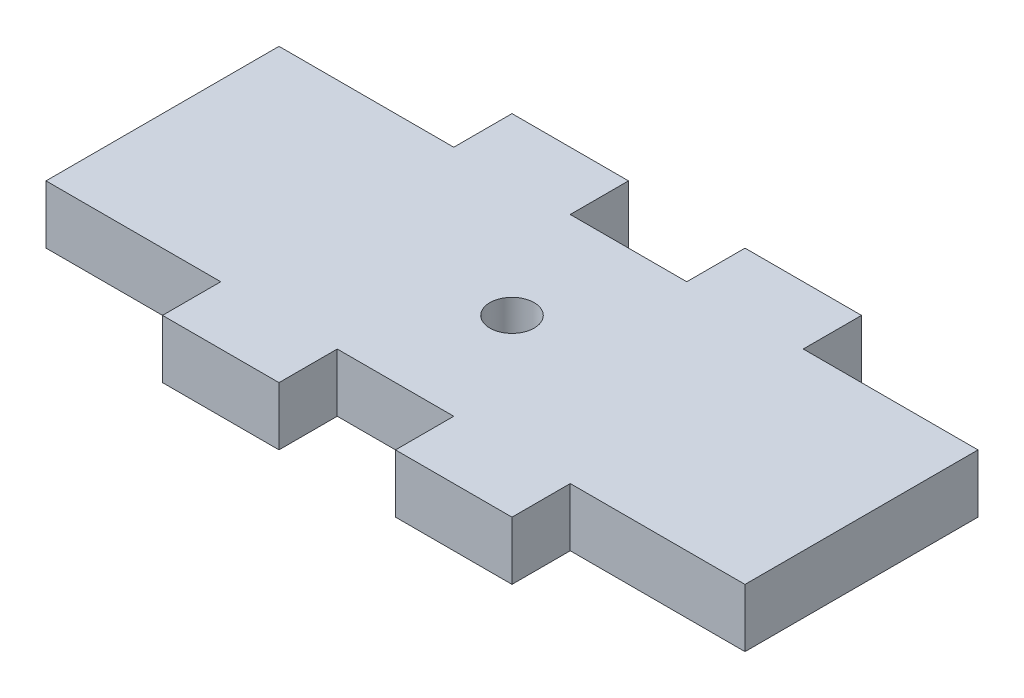
ISO-10303-21;
HEADER;
FILE_DESCRIPTION(('STEP AP214'),'2;1');
FILE_NAME('part.step','',(''),(''),'','','');
FILE_SCHEMA(('AUTOMOTIVE_DESIGN { 1 0 10303 214 1 1 1 1 }'));
ENDSEC;
DATA;
#1=APPLICATION_CONTEXT('core data for automotive mechanical design processes');
#2=APPLICATION_PROTOCOL_DEFINITION('international standard','automotive_design',2000,#1);
#3=PRODUCT_CONTEXT('',#1,'mechanical');
#4=PRODUCT('Part','Part','',(#3));
#5=PRODUCT_RELATED_PRODUCT_CATEGORY('part','',(#4));
#6=PRODUCT_DEFINITION_FORMATION('','',#4);
#7=PRODUCT_DEFINITION_CONTEXT('part definition',#1,'design');
#8=PRODUCT_DEFINITION('design','',#6,#7);
#9=PRODUCT_DEFINITION_SHAPE('','',#8);
#10=(LENGTH_UNIT() NAMED_UNIT(*) SI_UNIT(.MILLI.,.METRE.));
#11=(NAMED_UNIT(*) PLANE_ANGLE_UNIT() SI_UNIT($,.RADIAN.));
#12=(NAMED_UNIT(*) SI_UNIT($,.STERADIAN.) SOLID_ANGLE_UNIT());
#13=UNCERTAINTY_MEASURE_WITH_UNIT(LENGTH_MEASURE(1.E-05),#10,'distance_accuracy_value','');
#14=(GEOMETRIC_REPRESENTATION_CONTEXT(3) GLOBAL_UNCERTAINTY_ASSIGNED_CONTEXT((#13)) GLOBAL_UNIT_ASSIGNED_CONTEXT((#10,
#11,#12)) REPRESENTATION_CONTEXT('',''));
#15=CARTESIAN_POINT('',(0.,0.,0.));
#16=DIRECTION('',(0.,0.,1.));
#17=DIRECTION('',(1.,0.,0.));
#18=AXIS2_PLACEMENT_3D('',#15,#16,#17);
#19=CARTESIAN_POINT('',(12.7,6.35,0.));
#20=DIRECTION('',(1.,0.,0.));
#21=DIRECTION('',(0.,0.,-1.));
#22=AXIS2_PLACEMENT_3D('',#19,#20,#21);
#23=PLANE('',#22);
#24=DIRECTION('',(0.,0.,1.));
#25=VECTOR('',#24,1.);
#26=CARTESIAN_POINT('',(12.7,0.,0.));
#27=LINE('',#26,#25);
#28=CARTESIAN_POINT('',(12.7,0.,12.7));
#29=VERTEX_POINT('',#28);
#30=CARTESIAN_POINT('',(12.7,0.,19.05));
#31=VERTEX_POINT('',#30);
#32=EDGE_CURVE('E248',#29,#31,#27,.T.);
#33=ORIENTED_EDGE('',*,*,#32,.F.);
#34=DIRECTION('',(0.,-1.,0.));
#35=VECTOR('',#34,1.);
#36=CARTESIAN_POINT('',(12.7,6.35,12.7));
#37=LINE('',#36,#35);
#38=CARTESIAN_POINT('',(12.7,6.35,12.7));
#39=VERTEX_POINT('',#38);
#40=EDGE_CURVE('E11',#39,#29,#37,.T.);
#41=ORIENTED_EDGE('',*,*,#40,.F.);
#42=DIRECTION('',(0.,0.,1.));
#43=VECTOR('',#42,1.);
#44=CARTESIAN_POINT('',(12.7,6.35,0.));
#45=LINE('',#44,#43);
#46=CARTESIAN_POINT('',(12.7,6.35,19.05));
#47=VERTEX_POINT('',#46);
#48=EDGE_CURVE('E390',#39,#47,#45,.T.);
#49=ORIENTED_EDGE('',*,*,#48,.T.);
#50=DIRECTION('',(0.,-1.,0.));
#51=VECTOR('',#50,1.);
#52=CARTESIAN_POINT('',(12.7,6.35,19.05));
#53=LINE('',#52,#51);
#54=EDGE_CURVE('E122',#47,#31,#53,.T.);
#55=ORIENTED_EDGE('',*,*,#54,.T.);
#56=EDGE_LOOP('',(#33,#41,#49,#55));
#57=FACE_BOUND('',#56,.T.);
#58=ADVANCED_FACE('F35',(#57),#23,.T.);
#59=CARTESIAN_POINT('',(0.,6.35,12.7));
#60=DIRECTION('',(0.,0.,-1.));
#61=DIRECTION('',(-1.,0.,0.));
#62=AXIS2_PLACEMENT_3D('',#59,#60,#61);
#63=PLANE('',#62);
#64=DIRECTION('',(1.,0.,0.));
#65=VECTOR('',#64,1.);
#66=CARTESIAN_POINT('',(0.,0.,12.7));
#67=LINE('',#66,#65);
#68=CARTESIAN_POINT('',(31.75,0.,12.7));
#69=VERTEX_POINT('',#68);
#70=EDGE_CURVE('E246',#29,#69,#67,.T.);
#71=ORIENTED_EDGE('',*,*,#70,.T.);
#72=DIRECTION('',(0.,-1.,0.));
#73=VECTOR('',#72,1.);
#74=CARTESIAN_POINT('',(31.75,6.35,12.7));
#75=LINE('',#74,#73);
#76=CARTESIAN_POINT('',(31.75,6.35,12.7));
#77=VERTEX_POINT('',#76);
#78=EDGE_CURVE('E44',#77,#69,#75,.T.);
#79=ORIENTED_EDGE('',*,*,#78,.F.);
#80=DIRECTION('',(1.,0.,0.));
#81=VECTOR('',#80,1.);
#82=CARTESIAN_POINT('',(0.,6.35,12.7));
#83=LINE('',#82,#81);
#84=EDGE_CURVE('E392',#39,#77,#83,.T.);
#85=ORIENTED_EDGE('',*,*,#84,.F.);
#86=ORIENTED_EDGE('',*,*,#40,.T.);
#87=EDGE_LOOP('',(#71,#79,#85,#86));
#88=FACE_BOUND('',#87,.T.);
#89=ADVANCED_FACE('F247',(#88),#63,.F.);
#90=CARTESIAN_POINT('',(31.75,6.35,0.));
#91=DIRECTION('',(-1.,0.,0.));
#92=DIRECTION('',(0.,0.,1.));
#93=AXIS2_PLACEMENT_3D('',#90,#91,#92);
#94=PLANE('',#93);
#95=DIRECTION('',(0.,0.,-1.));
#96=VECTOR('',#95,1.);
#97=CARTESIAN_POINT('',(31.75,0.,0.));
#98=LINE('',#97,#96);
#99=CARTESIAN_POINT('',(31.75,0.,-12.7));
#100=VERTEX_POINT('',#99);
#101=EDGE_CURVE('E240',#69,#100,#98,.T.);
#102=ORIENTED_EDGE('',*,*,#101,.T.);
#103=DIRECTION('',(0.,-1.,0.));
#104=VECTOR('',#103,1.);
#105=CARTESIAN_POINT('',(31.75,6.35,-12.7));
#106=LINE('',#105,#104);
#107=CARTESIAN_POINT('',(31.75,6.35,-12.7));
#108=VERTEX_POINT('',#107);
#109=EDGE_CURVE('E232',#108,#100,#106,.T.);
#110=ORIENTED_EDGE('',*,*,#109,.F.);
#111=DIRECTION('',(0.,0.,-1.));
#112=VECTOR('',#111,1.);
#113=CARTESIAN_POINT('',(31.75,6.35,0.));
#114=LINE('',#113,#112);
#115=EDGE_CURVE('E242',#77,#108,#114,.T.);
#116=ORIENTED_EDGE('',*,*,#115,.F.);
#117=ORIENTED_EDGE('',*,*,#78,.T.);
#118=EDGE_LOOP('',(#102,#110,#116,#117));
#119=FACE_BOUND('',#118,.T.);
#120=ADVANCED_FACE('F238',(#119),#94,.F.);
#121=CARTESIAN_POINT('',(0.,6.35,-12.7));
#122=DIRECTION('',(0.,0.,-1.));
#123=DIRECTION('',(-1.,0.,0.));
#124=AXIS2_PLACEMENT_3D('',#121,#122,#123);
#125=PLANE('',#124);
#126=DIRECTION('',(1.,0.,0.));
#127=VECTOR('',#126,1.);
#128=CARTESIAN_POINT('',(0.,0.,-12.7));
#129=LINE('',#128,#127);
#130=CARTESIAN_POINT('',(12.7,0.,-12.7));
#131=VERTEX_POINT('',#130);
#132=EDGE_CURVE('E250',#131,#100,#129,.T.);
#133=ORIENTED_EDGE('',*,*,#132,.F.);
#134=DIRECTION('',(0.,-1.,0.));
#135=VECTOR('',#134,1.);
#136=CARTESIAN_POINT('',(12.7,6.35,-12.7));
#137=LINE('',#136,#135);
#138=CARTESIAN_POINT('',(12.7,6.35,-12.7));
#139=VERTEX_POINT('',#138);
#140=EDGE_CURVE('E230',#139,#131,#137,.T.);
#141=ORIENTED_EDGE('',*,*,#140,.F.);
#142=DIRECTION('',(1.,0.,0.));
#143=VECTOR('',#142,1.);
#144=CARTESIAN_POINT('',(0.,6.35,-12.7));
#145=LINE('',#144,#143);
#146=EDGE_CURVE('E397',#139,#108,#145,.T.);
#147=ORIENTED_EDGE('',*,*,#146,.T.);
#148=ORIENTED_EDGE('',*,*,#109,.T.);
#149=EDGE_LOOP('',(#133,#141,#147,#148));
#150=FACE_BOUND('',#149,.T.);
#151=ADVANCED_FACE('F325',(#150),#125,.T.);
#152=CARTESIAN_POINT('',(12.7,6.35,0.));
#153=DIRECTION('',(-1.,0.,0.));
#154=DIRECTION('',(0.,0.,1.));
#155=AXIS2_PLACEMENT_3D('',#152,#153,#154);
#156=PLANE('',#155);
#157=DIRECTION('',(0.,0.,-1.));
#158=VECTOR('',#157,1.);
#159=CARTESIAN_POINT('',(12.7,0.,0.));
#160=LINE('',#159,#158);
#161=CARTESIAN_POINT('',(12.7,0.,-19.05));
#162=VERTEX_POINT('',#161);
#163=EDGE_CURVE('E257',#131,#162,#160,.T.);
#164=ORIENTED_EDGE('',*,*,#163,.T.);
#165=DIRECTION('',(0.,-1.,0.));
#166=VECTOR('',#165,1.);
#167=CARTESIAN_POINT('',(12.7,6.35,-19.05));
#168=LINE('',#167,#166);
#169=CARTESIAN_POINT('',(12.7,6.35,-19.05));
#170=VERTEX_POINT('',#169);
#171=EDGE_CURVE('E228',#170,#162,#168,.T.);
#172=ORIENTED_EDGE('',*,*,#171,.F.);
#173=DIRECTION('',(0.,0.,-1.));
#174=VECTOR('',#173,1.);
#175=CARTESIAN_POINT('',(12.7,6.35,0.));
#176=LINE('',#175,#174);
#177=EDGE_CURVE('E400',#139,#170,#176,.T.);
#178=ORIENTED_EDGE('',*,*,#177,.F.);
#179=ORIENTED_EDGE('',*,*,#140,.T.);
#180=EDGE_LOOP('',(#164,#172,#178,#179));
#181=FACE_BOUND('',#180,.T.);
#182=ADVANCED_FACE('F328',(#181),#156,.F.);
#183=CARTESIAN_POINT('',(0.,6.35,-19.05));
#184=DIRECTION('',(0.,0.,-1.));
#185=DIRECTION('',(-1.,0.,0.));
#186=AXIS2_PLACEMENT_3D('',#183,#184,#185);
#187=PLANE('',#186);
#188=DIRECTION('',(1.,0.,0.));
#189=VECTOR('',#188,1.);
#190=CARTESIAN_POINT('',(0.,0.,-19.05));
#191=LINE('',#190,#189);
#192=CARTESIAN_POINT('',(0.,0.,-19.05));
#193=VERTEX_POINT('',#192);
#194=EDGE_CURVE('E260',#193,#162,#191,.T.);
#195=ORIENTED_EDGE('',*,*,#194,.F.);
#196=DIRECTION('',(0.,-1.,0.));
#197=VECTOR('',#196,1.);
#198=CARTESIAN_POINT('',(0.,6.35,-19.05));
#199=LINE('',#198,#197);
#200=CARTESIAN_POINT('',(0.,6.35,-19.05));
#201=VERTEX_POINT('',#200);
#202=EDGE_CURVE('E226',#201,#193,#199,.T.);
#203=ORIENTED_EDGE('',*,*,#202,.F.);
#204=DIRECTION('',(1.,0.,0.));
#205=VECTOR('',#204,1.);
#206=CARTESIAN_POINT('',(0.,6.35,-19.05));
#207=LINE('',#206,#205);
#208=EDGE_CURVE('E402',#201,#170,#207,.T.);
#209=ORIENTED_EDGE('',*,*,#208,.T.);
#210=ORIENTED_EDGE('',*,*,#171,.T.);
#211=EDGE_LOOP('',(#195,#203,#209,#210));
#212=FACE_BOUND('',#211,.T.);
#213=ADVANCED_FACE('F332',(#212),#187,.T.);
#214=CARTESIAN_POINT('',(0.,6.35,0.));
#215=DIRECTION('',(-1.,0.,0.));
#216=DIRECTION('',(0.,0.,1.));
#217=AXIS2_PLACEMENT_3D('',#214,#215,#216);
#218=PLANE('',#217);
#219=DIRECTION('',(0.,0.,-1.));
#220=VECTOR('',#219,1.);
#221=CARTESIAN_POINT('',(0.,0.,0.));
#222=LINE('',#221,#220);
#223=CARTESIAN_POINT('',(0.,0.,-12.7));
#224=VERTEX_POINT('',#223);
#225=EDGE_CURVE('E263',#224,#193,#222,.T.);
#226=ORIENTED_EDGE('',*,*,#225,.F.);
#227=DIRECTION('',(0.,-1.,0.));
#228=VECTOR('',#227,1.);
#229=CARTESIAN_POINT('',(0.,6.35,-12.7));
#230=LINE('',#229,#228);
#231=CARTESIAN_POINT('',(0.,6.35,-12.7));
#232=VERTEX_POINT('',#231);
#233=EDGE_CURVE('E224',#232,#224,#230,.T.);
#234=ORIENTED_EDGE('',*,*,#233,.F.);
#235=DIRECTION('',(0.,0.,-1.));
#236=VECTOR('',#235,1.);
#237=CARTESIAN_POINT('',(0.,6.35,0.));
#238=LINE('',#237,#236);
#239=EDGE_CURVE('E405',#232,#201,#238,.T.);
#240=ORIENTED_EDGE('',*,*,#239,.T.);
#241=ORIENTED_EDGE('',*,*,#202,.T.);
#242=EDGE_LOOP('',(#226,#234,#240,#241));
#243=FACE_BOUND('',#242,.T.);
#244=ADVANCED_FACE('F336',(#243),#218,.T.);
#245=CARTESIAN_POINT('',(0.,6.35,-12.7));
#246=DIRECTION('',(0.,0.,-1.));
#247=DIRECTION('',(-1.,0.,0.));
#248=AXIS2_PLACEMENT_3D('',#245,#246,#247);
#249=PLANE('',#248);
#250=DIRECTION('',(1.,0.,0.));
#251=VECTOR('',#250,1.);
#252=CARTESIAN_POINT('',(0.,0.,-12.7));
#253=LINE('',#252,#251);
#254=CARTESIAN_POINT('',(-12.7,0.,-12.7));
#255=VERTEX_POINT('',#254);
#256=EDGE_CURVE('E266',#255,#224,#253,.T.);
#257=ORIENTED_EDGE('',*,*,#256,.F.);
#258=DIRECTION('',(0.,-1.,0.));
#259=VECTOR('',#258,1.);
#260=CARTESIAN_POINT('',(-12.7,6.35,-12.7));
#261=LINE('',#260,#259);
#262=CARTESIAN_POINT('',(-12.7,6.35,-12.7));
#263=VERTEX_POINT('',#262);
#264=EDGE_CURVE('E222',#263,#255,#261,.T.);
#265=ORIENTED_EDGE('',*,*,#264,.F.);
#266=DIRECTION('',(1.,0.,0.));
#267=VECTOR('',#266,1.);
#268=CARTESIAN_POINT('',(0.,6.35,-12.7));
#269=LINE('',#268,#267);
#270=EDGE_CURVE('E408',#263,#232,#269,.T.);
#271=ORIENTED_EDGE('',*,*,#270,.T.);
#272=ORIENTED_EDGE('',*,*,#233,.T.);
#273=EDGE_LOOP('',(#257,#265,#271,#272));
#274=FACE_BOUND('',#273,.T.);
#275=ADVANCED_FACE('F340',(#274),#249,.T.);
#276=CARTESIAN_POINT('',(-12.7,6.35,0.));
#277=DIRECTION('',(-1.,0.,0.));
#278=DIRECTION('',(0.,0.,1.));
#279=AXIS2_PLACEMENT_3D('',#276,#277,#278);
#280=PLANE('',#279);
#281=DIRECTION('',(0.,0.,-1.));
#282=VECTOR('',#281,1.);
#283=CARTESIAN_POINT('',(-12.7,0.,0.));
#284=LINE('',#283,#282);
#285=CARTESIAN_POINT('',(-12.7,0.,-19.05));
#286=VERTEX_POINT('',#285);
#287=EDGE_CURVE('E269',#255,#286,#284,.T.);
#288=ORIENTED_EDGE('',*,*,#287,.T.);
#289=DIRECTION('',(0.,-1.,0.));
#290=VECTOR('',#289,1.);
#291=CARTESIAN_POINT('',(-12.7,6.35,-19.05));
#292=LINE('',#291,#290);
#293=CARTESIAN_POINT('',(-12.7,6.35,-19.05));
#294=VERTEX_POINT('',#293);
#295=EDGE_CURVE('E219',#294,#286,#292,.T.);
#296=ORIENTED_EDGE('',*,*,#295,.F.);
#297=DIRECTION('',(0.,0.,-1.));
#298=VECTOR('',#297,1.);
#299=CARTESIAN_POINT('',(-12.7,6.35,0.));
#300=LINE('',#299,#298);
#301=EDGE_CURVE('E411',#263,#294,#300,.T.);
#302=ORIENTED_EDGE('',*,*,#301,.F.);
#303=ORIENTED_EDGE('',*,*,#264,.T.);
#304=EDGE_LOOP('',(#288,#296,#302,#303));
#305=FACE_BOUND('',#304,.T.);
#306=ADVANCED_FACE('F344',(#305),#280,.F.);
#307=CARTESIAN_POINT('',(0.,6.35,-19.05));
#308=DIRECTION('',(0.,0.,1.));
#309=DIRECTION('',(1.,0.,0.));
#310=AXIS2_PLACEMENT_3D('',#307,#308,#309);
#311=PLANE('',#310);
#312=DIRECTION('',(-1.,0.,0.));
#313=VECTOR('',#312,1.);
#314=CARTESIAN_POINT('',(0.,0.,-19.05));
#315=LINE('',#314,#313);
#316=CARTESIAN_POINT('',(-25.4,0.,-19.05));
#317=VERTEX_POINT('',#316);
#318=EDGE_CURVE('E272',#286,#317,#315,.T.);
#319=ORIENTED_EDGE('',*,*,#318,.T.);
#320=DIRECTION('',(0.,-1.,0.));
#321=VECTOR('',#320,1.);
#322=CARTESIAN_POINT('',(-25.4,6.35,-19.05));
#323=LINE('',#322,#321);
#324=CARTESIAN_POINT('',(-25.4,6.35,-19.05));
#325=VERTEX_POINT('',#324);
#326=EDGE_CURVE('E217',#325,#317,#323,.T.);
#327=ORIENTED_EDGE('',*,*,#326,.F.);
#328=DIRECTION('',(-1.,0.,0.));
#329=VECTOR('',#328,1.);
#330=CARTESIAN_POINT('',(0.,6.35,-19.05));
#331=LINE('',#330,#329);
#332=EDGE_CURVE('E414',#294,#325,#331,.T.);
#333=ORIENTED_EDGE('',*,*,#332,.F.);
#334=ORIENTED_EDGE('',*,*,#295,.T.);
#335=EDGE_LOOP('',(#319,#327,#333,#334));
#336=FACE_BOUND('',#335,.T.);
#337=ADVANCED_FACE('F348',(#336),#311,.F.);
#338=CARTESIAN_POINT('',(-25.4,6.35,0.));
#339=DIRECTION('',(-1.,0.,0.));
#340=DIRECTION('',(0.,0.,1.));
#341=AXIS2_PLACEMENT_3D('',#338,#339,#340);
#342=PLANE('',#341);
#343=DIRECTION('',(0.,0.,-1.));
#344=VECTOR('',#343,1.);
#345=CARTESIAN_POINT('',(-25.4,0.,0.));
#346=LINE('',#345,#344);
#347=CARTESIAN_POINT('',(-25.4,0.,-12.7));
#348=VERTEX_POINT('',#347);
#349=EDGE_CURVE('E275',#348,#317,#346,.T.);
#350=ORIENTED_EDGE('',*,*,#349,.F.);
#351=DIRECTION('',(0.,-1.,0.));
#352=VECTOR('',#351,1.);
#353=CARTESIAN_POINT('',(-25.4,6.35,-12.7));
#354=LINE('',#353,#352);
#355=CARTESIAN_POINT('',(-25.4,6.35,-12.7));
#356=VERTEX_POINT('',#355);
#357=EDGE_CURVE('E215',#356,#348,#354,.T.);
#358=ORIENTED_EDGE('',*,*,#357,.F.);
#359=DIRECTION('',(0.,0.,-1.));
#360=VECTOR('',#359,1.);
#361=CARTESIAN_POINT('',(-25.4,6.35,0.));
#362=LINE('',#361,#360);
#363=EDGE_CURVE('E416',#356,#325,#362,.T.);
#364=ORIENTED_EDGE('',*,*,#363,.T.);
#365=ORIENTED_EDGE('',*,*,#326,.T.);
#366=EDGE_LOOP('',(#350,#358,#364,#365));
#367=FACE_BOUND('',#366,.T.);
#368=ADVANCED_FACE('F352',(#367),#342,.T.);
#369=CARTESIAN_POINT('',(0.,6.35,-12.6999999999999));
#370=DIRECTION('',(0.,0.,-1.));
#371=DIRECTION('',(-1.,0.,0.));
#372=AXIS2_PLACEMENT_3D('',#369,#370,#371);
#373=PLANE('',#372);
#374=DIRECTION('',(1.,0.,0.));
#375=VECTOR('',#374,1.);
#376=CARTESIAN_POINT('',(0.,0.,-12.6999999999999));
#377=LINE('',#376,#375);
#378=CARTESIAN_POINT('',(-44.45,0.,-12.7));
#379=VERTEX_POINT('',#378);
#380=EDGE_CURVE('E278',#379,#348,#377,.T.);
#381=ORIENTED_EDGE('',*,*,#380,.F.);
#382=DIRECTION('',(0.,-1.,0.));
#383=VECTOR('',#382,1.);
#384=CARTESIAN_POINT('',(-44.45,6.35,-12.7));
#385=LINE('',#384,#383);
#386=CARTESIAN_POINT('',(-44.45,6.35,-12.7));
#387=VERTEX_POINT('',#386);
#388=EDGE_CURVE('E213',#387,#379,#385,.T.);
#389=ORIENTED_EDGE('',*,*,#388,.F.);
#390=DIRECTION('',(1.,0.,0.));
#391=VECTOR('',#390,1.);
#392=CARTESIAN_POINT('',(0.,6.35,-12.6999999999999));
#393=LINE('',#392,#391);
#394=EDGE_CURVE('E419',#387,#356,#393,.T.);
#395=ORIENTED_EDGE('',*,*,#394,.T.);
#396=ORIENTED_EDGE('',*,*,#357,.T.);
#397=EDGE_LOOP('',(#381,#389,#395,#396));
#398=FACE_BOUND('',#397,.T.);
#399=ADVANCED_FACE('F356',(#398),#373,.T.);
#400=CARTESIAN_POINT('',(-44.45,6.35,0.));
#401=DIRECTION('',(1.,0.,0.));
#402=DIRECTION('',(0.,0.,-1.));
#403=AXIS2_PLACEMENT_3D('',#400,#401,#402);
#404=PLANE('',#403);
#405=DIRECTION('',(0.,0.,1.));
#406=VECTOR('',#405,1.);
#407=CARTESIAN_POINT('',(-44.45,0.,0.));
#408=LINE('',#407,#406);
#409=CARTESIAN_POINT('',(-44.45,0.,12.7));
#410=VERTEX_POINT('',#409);
#411=EDGE_CURVE('E281',#379,#410,#408,.T.);
#412=ORIENTED_EDGE('',*,*,#411,.T.);
#413=DIRECTION('',(0.,-1.,0.));
#414=VECTOR('',#413,1.);
#415=CARTESIAN_POINT('',(-44.45,6.35,12.7));
#416=LINE('',#415,#414);
#417=CARTESIAN_POINT('',(-44.45,6.35,12.7));
#418=VERTEX_POINT('',#417);
#419=EDGE_CURVE('E211',#418,#410,#416,.T.);
#420=ORIENTED_EDGE('',*,*,#419,.F.);
#421=DIRECTION('',(0.,0.,1.));
#422=VECTOR('',#421,1.);
#423=CARTESIAN_POINT('',(-44.45,6.35,0.));
#424=LINE('',#423,#422);
#425=EDGE_CURVE('E422',#387,#418,#424,.T.);
#426=ORIENTED_EDGE('',*,*,#425,.F.);
#427=ORIENTED_EDGE('',*,*,#388,.T.);
#428=EDGE_LOOP('',(#412,#420,#426,#427));
#429=FACE_BOUND('',#428,.T.);
#430=ADVANCED_FACE('F360',(#429),#404,.F.);
#431=CARTESIAN_POINT('',(0.,6.35,12.7));
#432=DIRECTION('',(0.,0.,1.));
#433=DIRECTION('',(1.,0.,0.));
#434=AXIS2_PLACEMENT_3D('',#431,#432,#433);
#435=PLANE('',#434);
#436=DIRECTION('',(-1.,0.,0.));
#437=VECTOR('',#436,1.);
#438=CARTESIAN_POINT('',(0.,0.,12.7));
#439=LINE('',#438,#437);
#440=CARTESIAN_POINT('',(-25.4,0.,12.7));
#441=VERTEX_POINT('',#440);
#442=EDGE_CURVE('E284',#441,#410,#439,.T.);
#443=ORIENTED_EDGE('',*,*,#442,.F.);
#444=DIRECTION('',(0.,-1.,0.));
#445=VECTOR('',#444,1.);
#446=CARTESIAN_POINT('',(-25.4,6.35,12.7));
#447=LINE('',#446,#445);
#448=CARTESIAN_POINT('',(-25.4,6.35,12.7));
#449=VERTEX_POINT('',#448);
#450=EDGE_CURVE('E209',#449,#441,#447,.T.);
#451=ORIENTED_EDGE('',*,*,#450,.F.);
#452=DIRECTION('',(-1.,0.,0.));
#453=VECTOR('',#452,1.);
#454=CARTESIAN_POINT('',(0.,6.35,12.7));
#455=LINE('',#454,#453);
#456=EDGE_CURVE('E424',#449,#418,#455,.T.);
#457=ORIENTED_EDGE('',*,*,#456,.T.);
#458=ORIENTED_EDGE('',*,*,#419,.T.);
#459=EDGE_LOOP('',(#443,#451,#457,#458));
#460=FACE_BOUND('',#459,.T.);
#461=ADVANCED_FACE('F364',(#460),#435,.T.);
#462=CARTESIAN_POINT('',(-25.4,6.35,0.));
#463=DIRECTION('',(1.,0.,0.));
#464=DIRECTION('',(0.,0.,-1.));
#465=AXIS2_PLACEMENT_3D('',#462,#463,#464);
#466=PLANE('',#465);
#467=DIRECTION('',(0.,0.,1.));
#468=VECTOR('',#467,1.);
#469=CARTESIAN_POINT('',(-25.4,0.,0.));
#470=LINE('',#469,#468);
#471=CARTESIAN_POINT('',(-25.4,0.,19.05));
#472=VERTEX_POINT('',#471);
#473=EDGE_CURVE('E287',#441,#472,#470,.T.);
#474=ORIENTED_EDGE('',*,*,#473,.T.);
#475=DIRECTION('',(0.,-1.,0.));
#476=VECTOR('',#475,1.);
#477=CARTESIAN_POINT('',(-25.4,6.35,19.05));
#478=LINE('',#477,#476);
#479=CARTESIAN_POINT('',(-25.4,6.35,19.05));
#480=VERTEX_POINT('',#479);
#481=EDGE_CURVE('E207',#480,#472,#478,.T.);
#482=ORIENTED_EDGE('',*,*,#481,.F.);
#483=DIRECTION('',(0.,0.,1.));
#484=VECTOR('',#483,1.);
#485=CARTESIAN_POINT('',(-25.4,6.35,0.));
#486=LINE('',#485,#484);
#487=EDGE_CURVE('E427',#449,#480,#486,.T.);
#488=ORIENTED_EDGE('',*,*,#487,.F.);
#489=ORIENTED_EDGE('',*,*,#450,.T.);
#490=EDGE_LOOP('',(#474,#482,#488,#489));
#491=FACE_BOUND('',#490,.T.);
#492=ADVANCED_FACE('F368',(#491),#466,.F.);
#493=CARTESIAN_POINT('',(0.,6.35,19.05));
#494=DIRECTION('',(0.,0.,1.));
#495=DIRECTION('',(1.,0.,0.));
#496=AXIS2_PLACEMENT_3D('',#493,#494,#495);
#497=PLANE('',#496);
#498=DIRECTION('',(-1.,0.,0.));
#499=VECTOR('',#498,1.);
#500=CARTESIAN_POINT('',(0.,0.,19.05));
#501=LINE('',#500,#499);
#502=CARTESIAN_POINT('',(-12.7,0.,19.05));
#503=VERTEX_POINT('',#502);
#504=EDGE_CURVE('E290',#503,#472,#501,.T.);
#505=ORIENTED_EDGE('',*,*,#504,.F.);
#506=DIRECTION('',(0.,-1.,0.));
#507=VECTOR('',#506,1.);
#508=CARTESIAN_POINT('',(-12.7,6.35,19.05));
#509=LINE('',#508,#507);
#510=CARTESIAN_POINT('',(-12.7,6.35,19.05));
#511=VERTEX_POINT('',#510);
#512=EDGE_CURVE('E201',#511,#503,#509,.T.);
#513=ORIENTED_EDGE('',*,*,#512,.F.);
#514=DIRECTION('',(-1.,0.,0.));
#515=VECTOR('',#514,1.);
#516=CARTESIAN_POINT('',(0.,6.35,19.05));
#517=LINE('',#516,#515);
#518=EDGE_CURVE('E429',#511,#480,#517,.T.);
#519=ORIENTED_EDGE('',*,*,#518,.T.);
#520=ORIENTED_EDGE('',*,*,#481,.T.);
#521=EDGE_LOOP('',(#505,#513,#519,#520));
#522=FACE_BOUND('',#521,.T.);
#523=ADVANCED_FACE('F372',(#522),#497,.T.);
#524=CARTESIAN_POINT('',(-12.7,6.35,0.));
#525=DIRECTION('',(1.,0.,0.));
#526=DIRECTION('',(0.,0.,-1.));
#527=AXIS2_PLACEMENT_3D('',#524,#525,#526);
#528=PLANE('',#527);
#529=DIRECTION('',(0.,0.,1.));
#530=VECTOR('',#529,1.);
#531=CARTESIAN_POINT('',(-12.7,0.,0.));
#532=LINE('',#531,#530);
#533=CARTESIAN_POINT('',(-12.7,0.,12.7));
#534=VERTEX_POINT('',#533);
#535=EDGE_CURVE('E293',#534,#503,#532,.T.);
#536=ORIENTED_EDGE('',*,*,#535,.F.);
#537=DIRECTION('',(0.,-1.,0.));
#538=VECTOR('',#537,1.);
#539=CARTESIAN_POINT('',(-12.7,6.35,12.7));
#540=LINE('',#539,#538);
#541=CARTESIAN_POINT('',(-12.7,6.35,12.7));
#542=VERTEX_POINT('',#541);
#543=EDGE_CURVE('E199',#542,#534,#540,.T.);
#544=ORIENTED_EDGE('',*,*,#543,.F.);
#545=DIRECTION('',(0.,0.,1.));
#546=VECTOR('',#545,1.);
#547=CARTESIAN_POINT('',(-12.7,6.35,0.));
#548=LINE('',#547,#546);
#549=EDGE_CURVE('E193',#542,#511,#548,.T.);
#550=ORIENTED_EDGE('',*,*,#549,.T.);
#551=ORIENTED_EDGE('',*,*,#512,.T.);
#552=EDGE_LOOP('',(#536,#544,#550,#551));
#553=FACE_BOUND('',#552,.T.);
#554=ADVANCED_FACE('F376',(#553),#528,.T.);
#555=CARTESIAN_POINT('',(0.,6.35,12.7));
#556=DIRECTION('',(0.,0.,-1.));
#557=DIRECTION('',(-1.,0.,0.));
#558=AXIS2_PLACEMENT_3D('',#555,#556,#557);
#559=PLANE('',#558);
#560=DIRECTION('',(1.,0.,0.));
#561=VECTOR('',#560,1.);
#562=CARTESIAN_POINT('',(0.,0.,12.7));
#563=LINE('',#562,#561);
#564=CARTESIAN_POINT('',(0.,0.,12.7));
#565=VERTEX_POINT('',#564);
#566=EDGE_CURVE('E198',#534,#565,#563,.T.);
#567=ORIENTED_EDGE('',*,*,#566,.T.);
#568=DIRECTION('',(0.,-1.,0.));
#569=VECTOR('',#568,1.);
#570=CARTESIAN_POINT('',(0.,6.35,12.7));
#571=LINE('',#570,#569);
#572=CARTESIAN_POINT('',(0.,6.35,12.7));
#573=VERTEX_POINT('',#572);
#574=EDGE_CURVE('E183',#573,#565,#571,.T.);
#575=ORIENTED_EDGE('',*,*,#574,.F.);
#576=DIRECTION('',(1.,0.,0.));
#577=VECTOR('',#576,1.);
#578=CARTESIAN_POINT('',(0.,6.35,12.7));
#579=LINE('',#578,#577);
#580=EDGE_CURVE('E186',#542,#573,#579,.T.);
#581=ORIENTED_EDGE('',*,*,#580,.F.);
#582=ORIENTED_EDGE('',*,*,#543,.T.);
#583=EDGE_LOOP('',(#567,#575,#581,#582));
#584=FACE_BOUND('',#583,.T.);
#585=ADVANCED_FACE('F196',(#584),#559,.F.);
#586=CARTESIAN_POINT('',(0.,6.35,0.));
#587=DIRECTION('',(1.,0.,0.));
#588=DIRECTION('',(0.,0.,-1.));
#589=AXIS2_PLACEMENT_3D('',#586,#587,#588);
#590=PLANE('',#589);
#591=DIRECTION('',(0.,0.,1.));
#592=VECTOR('',#591,1.);
#593=CARTESIAN_POINT('',(0.,0.,0.));
#594=LINE('',#593,#592);
#595=CARTESIAN_POINT('',(0.,0.,19.05));
#596=VERTEX_POINT('',#595);
#597=EDGE_CURVE('E297',#565,#596,#594,.T.);
#598=ORIENTED_EDGE('',*,*,#597,.T.);
#599=DIRECTION('',(0.,-1.,0.));
#600=VECTOR('',#599,1.);
#601=CARTESIAN_POINT('',(0.,6.35,19.05));
#602=LINE('',#601,#600);
#603=CARTESIAN_POINT('',(0.,6.35,19.05));
#604=VERTEX_POINT('',#603);
#605=EDGE_CURVE('E185',#604,#596,#602,.T.);
#606=ORIENTED_EDGE('',*,*,#605,.F.);
#607=DIRECTION('',(0.,0.,1.));
#608=VECTOR('',#607,1.);
#609=CARTESIAN_POINT('',(0.,6.35,0.));
#610=LINE('',#609,#608);
#611=EDGE_CURVE('E178',#573,#604,#610,.T.);
#612=ORIENTED_EDGE('',*,*,#611,.F.);
#613=ORIENTED_EDGE('',*,*,#574,.T.);
#614=EDGE_LOOP('',(#598,#606,#612,#613));
#615=FACE_BOUND('',#614,.T.);
#616=ADVANCED_FACE('F181',(#615),#590,.F.);
#617=CARTESIAN_POINT('',(-6.35000000000002,6.35,0.));
#618=DIRECTION('',(0.,-1.,0.));
#619=DIRECTION('',(0.,0.,-1.));
#620=AXIS2_PLACEMENT_3D('',#617,#618,#619);
#621=CYLINDRICAL_SURFACE('',#620,2.413);
#622=CARTESIAN_POINT('',(-6.35000000000002,6.35,0.));
#623=DIRECTION('',(0.,1.,0.));
#624=DIRECTION('',(0.,0.,1.));
#625=AXIS2_PLACEMENT_3D('',#622,#623,#624);
#626=CIRCLE('',#625,2.413);
#627=CARTESIAN_POINT('',(-6.35000000000002,6.35,2.413));
#628=VERTEX_POINT('',#627);
#629=EDGE_CURVE('E299',#628,#628,#626,.T.);
#630=ORIENTED_EDGE('',*,*,#629,.T.);
#631=EDGE_LOOP('',(#630));
#632=FACE_BOUND('',#631,.T.);
#633=CARTESIAN_POINT('',(-6.35000000000002,0.,0.));
#634=DIRECTION('',(0.,1.,0.));
#635=DIRECTION('',(0.,0.,1.));
#636=AXIS2_PLACEMENT_3D('',#633,#634,#635);
#637=CIRCLE('',#636,2.413);
#638=CARTESIAN_POINT('',(-6.35000000000002,0.,2.413));
#639=VERTEX_POINT('',#638);
#640=EDGE_CURVE('E252',#639,#639,#637,.T.);
#641=ORIENTED_EDGE('',*,*,#640,.F.);
#642=EDGE_LOOP('',(#641));
#643=FACE_BOUND('',#642,.T.);
#644=ADVANCED_FACE('F37',(#632,#643),#621,.F.);
#645=CARTESIAN_POINT('',(0.,6.35,19.05));
#646=DIRECTION('',(0.,0.,-1.));
#647=DIRECTION('',(-1.,0.,0.));
#648=AXIS2_PLACEMENT_3D('',#645,#646,#647);
#649=PLANE('',#648);
#650=DIRECTION('',(1.,0.,0.));
#651=VECTOR('',#650,1.);
#652=CARTESIAN_POINT('',(0.,0.,19.05));
#653=LINE('',#652,#651);
#654=EDGE_CURVE('E115',#596,#31,#653,.T.);
#655=ORIENTED_EDGE('',*,*,#654,.T.);
#656=ORIENTED_EDGE('',*,*,#54,.F.);
#657=DIRECTION('',(1.,0.,0.));
#658=VECTOR('',#657,1.);
#659=CARTESIAN_POINT('',(0.,6.35,19.05));
#660=LINE('',#659,#658);
#661=EDGE_CURVE('E52',#604,#47,#660,.T.);
#662=ORIENTED_EDGE('',*,*,#661,.F.);
#663=ORIENTED_EDGE('',*,*,#605,.T.);
#664=EDGE_LOOP('',(#655,#656,#662,#663));
#665=FACE_BOUND('',#664,.T.);
#666=ADVANCED_FACE('F307',(#665),#649,.F.);
#667=CARTESIAN_POINT('',(0.,6.35,0.));
#668=DIRECTION('',(0.,1.,0.));
#669=DIRECTION('',(0.,0.,1.));
#670=AXIS2_PLACEMENT_3D('',#667,#668,#669);
#671=PLANE('',#670);
#672=ORIENTED_EDGE('',*,*,#629,.F.);
#673=EDGE_LOOP('',(#672));
#674=FACE_BOUND('',#673,.T.);
#675=ORIENTED_EDGE('',*,*,#48,.F.);
#676=ORIENTED_EDGE('',*,*,#84,.T.);
#677=ORIENTED_EDGE('',*,*,#115,.T.);
#678=ORIENTED_EDGE('',*,*,#146,.F.);
#679=ORIENTED_EDGE('',*,*,#177,.T.);
#680=ORIENTED_EDGE('',*,*,#208,.F.);
#681=ORIENTED_EDGE('',*,*,#239,.F.);
#682=ORIENTED_EDGE('',*,*,#270,.F.);
#683=ORIENTED_EDGE('',*,*,#301,.T.);
#684=ORIENTED_EDGE('',*,*,#332,.T.);
#685=ORIENTED_EDGE('',*,*,#363,.F.);
#686=ORIENTED_EDGE('',*,*,#394,.F.);
#687=ORIENTED_EDGE('',*,*,#425,.T.);
#688=ORIENTED_EDGE('',*,*,#456,.F.);
#689=ORIENTED_EDGE('',*,*,#487,.T.);
#690=ORIENTED_EDGE('',*,*,#518,.F.);
#691=ORIENTED_EDGE('',*,*,#549,.F.);
#692=ORIENTED_EDGE('',*,*,#580,.T.);
#693=ORIENTED_EDGE('',*,*,#611,.T.);
#694=ORIENTED_EDGE('',*,*,#661,.T.);
#695=EDGE_LOOP('',(#675,#676,#677,#678,#679,#680,#681,#682,#683,#684,#685,#686,#687,#688,#689,
#690,#691,#692,#693,#694));
#696=FACE_BOUND('',#695,.T.);
#697=ADVANCED_FACE('F190',(#674,#696),#671,.T.);
#698=CARTESIAN_POINT('',(0.,0.,0.));
#699=DIRECTION('',(0.,1.,0.));
#700=DIRECTION('',(0.,0.,1.));
#701=AXIS2_PLACEMENT_3D('',#698,#699,#700);
#702=PLANE('',#701);
#703=ORIENTED_EDGE('',*,*,#640,.T.);
#704=EDGE_LOOP('',(#703));
#705=FACE_BOUND('',#704,.T.);
#706=ORIENTED_EDGE('',*,*,#32,.T.);
#707=ORIENTED_EDGE('',*,*,#654,.F.);
#708=ORIENTED_EDGE('',*,*,#597,.F.);
#709=ORIENTED_EDGE('',*,*,#566,.F.);
#710=ORIENTED_EDGE('',*,*,#535,.T.);
#711=ORIENTED_EDGE('',*,*,#504,.T.);
#712=ORIENTED_EDGE('',*,*,#473,.F.);
#713=ORIENTED_EDGE('',*,*,#442,.T.);
#714=ORIENTED_EDGE('',*,*,#411,.F.);
#715=ORIENTED_EDGE('',*,*,#380,.T.);
#716=ORIENTED_EDGE('',*,*,#349,.T.);
#717=ORIENTED_EDGE('',*,*,#318,.F.);
#718=ORIENTED_EDGE('',*,*,#287,.F.);
#719=ORIENTED_EDGE('',*,*,#256,.T.);
#720=ORIENTED_EDGE('',*,*,#225,.T.);
#721=ORIENTED_EDGE('',*,*,#194,.T.);
#722=ORIENTED_EDGE('',*,*,#163,.F.);
#723=ORIENTED_EDGE('',*,*,#132,.T.);
#724=ORIENTED_EDGE('',*,*,#101,.F.);
#725=ORIENTED_EDGE('',*,*,#70,.F.);
#726=EDGE_LOOP('',(#706,#707,#708,#709,#710,#711,#712,#713,#714,#715,#716,#717,#718,#719,#720,
#721,#722,#723,#724,#725));
#727=FACE_BOUND('',#726,.T.);
#728=ADVANCED_FACE('F304',(#705,#727),#702,.F.);
#729=CLOSED_SHELL('',(#58,#89,#120,#151,#182,#213,#244,#275,#306,#337,#368,#399,#430,#461,#492,
#523,#554,#585,#616,#644,#666,#697,#728));
#730=MANIFOLD_SOLID_BREP('B2',#729);
#731=ADVANCED_BREP_SHAPE_REPRESENTATION('',(#18,#730),#14);
#732=SHAPE_DEFINITION_REPRESENTATION(#9,#731);
ENDSEC;
END-ISO-10303-21;
